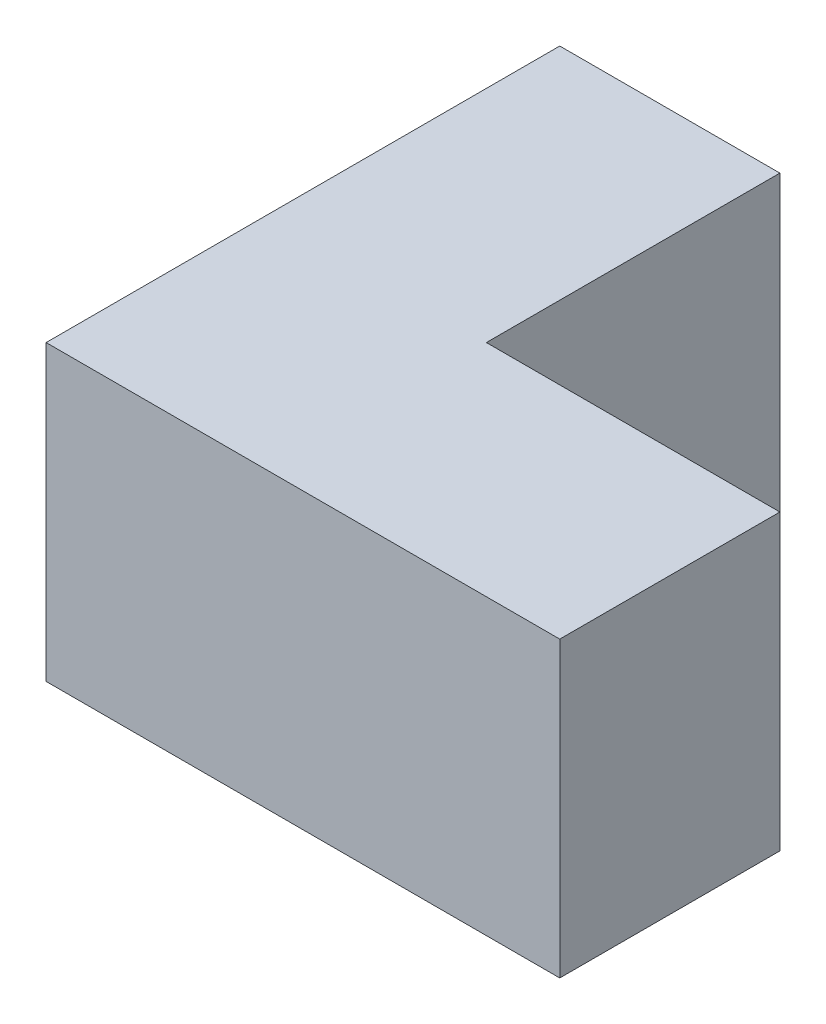
ISO-10303-21;
HEADER;
FILE_DESCRIPTION(('STEP AP214'),'2;1');
FILE_NAME('part.step','',(''),(''),'','','');
FILE_SCHEMA(('AUTOMOTIVE_DESIGN { 1 0 10303 214 1 1 1 1 }'));
ENDSEC;
DATA;
#1=APPLICATION_CONTEXT('core data for automotive mechanical design processes');
#2=APPLICATION_PROTOCOL_DEFINITION('international standard','automotive_design',2000,#1);
#3=PRODUCT_CONTEXT('',#1,'mechanical');
#4=PRODUCT('Part','Part','',(#3));
#5=PRODUCT_RELATED_PRODUCT_CATEGORY('part','',(#4));
#6=PRODUCT_DEFINITION_FORMATION('','',#4);
#7=PRODUCT_DEFINITION_CONTEXT('part definition',#1,'design');
#8=PRODUCT_DEFINITION('design','',#6,#7);
#9=PRODUCT_DEFINITION_SHAPE('','',#8);
#10=(LENGTH_UNIT() NAMED_UNIT(*) SI_UNIT(.MILLI.,.METRE.));
#11=(NAMED_UNIT(*) PLANE_ANGLE_UNIT() SI_UNIT($,.RADIAN.));
#12=(NAMED_UNIT(*) SI_UNIT($,.STERADIAN.) SOLID_ANGLE_UNIT());
#13=UNCERTAINTY_MEASURE_WITH_UNIT(LENGTH_MEASURE(1.E-05),#10,'distance_accuracy_value','');
#14=(GEOMETRIC_REPRESENTATION_CONTEXT(3) GLOBAL_UNCERTAINTY_ASSIGNED_CONTEXT((#13)) GLOBAL_UNIT_ASSIGNED_CONTEXT((#10,
#11,#12)) REPRESENTATION_CONTEXT('',''));
#15=CARTESIAN_POINT('',(0.,0.,0.));
#16=DIRECTION('',(0.,0.,1.));
#17=DIRECTION('',(1.,0.,0.));
#18=AXIS2_PLACEMENT_3D('',#15,#16,#17);
#19=CARTESIAN_POINT('',(20.,10.,0.));
#20=DIRECTION('',(0.,0.,1.));
#21=DIRECTION('',(1.,0.,0.));
#22=AXIS2_PLACEMENT_3D('',#19,#20,#21);
#23=PLANE('',#22);
#24=DIRECTION('',(-1.,0.,0.));
#25=VECTOR('',#24,1.);
#26=CARTESIAN_POINT('',(20.,-10.,0.));
#27=LINE('',#26,#25);
#28=CARTESIAN_POINT('',(20.,-10.,0.));
#29=VERTEX_POINT('',#28);
#30=CARTESIAN_POINT('',(0.,-10.,0.));
#31=VERTEX_POINT('',#30);
#32=EDGE_CURVE('E117',#29,#31,#27,.T.);
#33=ORIENTED_EDGE('',*,*,#32,.T.);
#34=DIRECTION('',(0.,-1.,0.));
#35=VECTOR('',#34,1.);
#36=CARTESIAN_POINT('',(0.,10.,0.));
#37=LINE('',#36,#35);
#38=CARTESIAN_POINT('',(0.,10.,0.));
#39=VERTEX_POINT('',#38);
#40=EDGE_CURVE('E11',#39,#31,#37,.T.);
#41=ORIENTED_EDGE('',*,*,#40,.F.);
#42=DIRECTION('',(-1.,0.,0.));
#43=VECTOR('',#42,1.);
#44=CARTESIAN_POINT('',(20.,10.,0.));
#45=LINE('',#44,#43);
#46=CARTESIAN_POINT('',(20.,10.,0.));
#47=VERTEX_POINT('',#46);
#48=EDGE_CURVE('E127',#47,#39,#45,.T.);
#49=ORIENTED_EDGE('',*,*,#48,.F.);
#50=DIRECTION('',(0.,-1.,0.));
#51=VECTOR('',#50,1.);
#52=CARTESIAN_POINT('',(20.,10.,0.));
#53=LINE('',#52,#51);
#54=EDGE_CURVE('E113',#47,#29,#53,.T.);
#55=ORIENTED_EDGE('',*,*,#54,.T.);
#56=EDGE_LOOP('',(#33,#41,#49,#55));
#57=FACE_BOUND('',#56,.T.);
#58=ADVANCED_FACE('F33',(#57),#23,.F.);
#59=CARTESIAN_POINT('',(0.,10.,0.));
#60=DIRECTION('',(-1.,0.,0.));
#61=DIRECTION('',(0.,0.,1.));
#62=AXIS2_PLACEMENT_3D('',#59,#60,#61);
#63=PLANE('',#62);
#64=DIRECTION('',(0.,0.,-1.));
#65=VECTOR('',#64,1.);
#66=CARTESIAN_POINT('',(0.,-10.,0.));
#67=LINE('',#66,#65);
#68=CARTESIAN_POINT('',(0.,-10.,-20.));
#69=VERTEX_POINT('',#68);
#70=EDGE_CURVE('E120',#31,#69,#67,.T.);
#71=ORIENTED_EDGE('',*,*,#70,.T.);
#72=DIRECTION('',(0.,-1.,0.));
#73=VECTOR('',#72,1.);
#74=CARTESIAN_POINT('',(0.,10.,-20.));
#75=LINE('',#74,#73);
#76=CARTESIAN_POINT('',(0.,10.,-20.));
#77=VERTEX_POINT('',#76);
#78=EDGE_CURVE('E41',#77,#69,#75,.T.);
#79=ORIENTED_EDGE('',*,*,#78,.F.);
#80=DIRECTION('',(0.,0.,-1.));
#81=VECTOR('',#80,1.);
#82=CARTESIAN_POINT('',(0.,10.,0.));
#83=LINE('',#82,#81);
#84=EDGE_CURVE('E86',#39,#77,#83,.T.);
#85=ORIENTED_EDGE('',*,*,#84,.F.);
#86=ORIENTED_EDGE('',*,*,#40,.T.);
#87=EDGE_LOOP('',(#71,#79,#85,#86));
#88=FACE_BOUND('',#87,.T.);
#89=ADVANCED_FACE('F151',(#88),#63,.F.);
#90=CARTESIAN_POINT('',(0.,10.,-20.));
#91=DIRECTION('',(0.,0.,1.));
#92=DIRECTION('',(1.,0.,0.));
#93=AXIS2_PLACEMENT_3D('',#90,#91,#92);
#94=PLANE('',#93);
#95=DIRECTION('',(-1.,0.,0.));
#96=VECTOR('',#95,1.);
#97=CARTESIAN_POINT('',(0.,-10.,-20.));
#98=LINE('',#97,#96);
#99=CARTESIAN_POINT('',(-15.,-10.,-20.));
#100=VERTEX_POINT('',#99);
#101=EDGE_CURVE('E122',#69,#100,#98,.T.);
#102=ORIENTED_EDGE('',*,*,#101,.T.);
#103=DIRECTION('',(0.,-1.,0.));
#104=VECTOR('',#103,1.);
#105=CARTESIAN_POINT('',(-15.,10.,-20.));
#106=LINE('',#105,#104);
#107=CARTESIAN_POINT('',(-15.,10.,-20.));
#108=VERTEX_POINT('',#107);
#109=EDGE_CURVE('E108',#108,#100,#106,.T.);
#110=ORIENTED_EDGE('',*,*,#109,.F.);
#111=DIRECTION('',(-1.,0.,0.));
#112=VECTOR('',#111,1.);
#113=CARTESIAN_POINT('',(0.,10.,-20.));
#114=LINE('',#113,#112);
#115=EDGE_CURVE('E99',#77,#108,#114,.T.);
#116=ORIENTED_EDGE('',*,*,#115,.F.);
#117=ORIENTED_EDGE('',*,*,#78,.T.);
#118=EDGE_LOOP('',(#102,#110,#116,#117));
#119=FACE_BOUND('',#118,.T.);
#120=ADVANCED_FACE('F133',(#119),#94,.F.);
#121=CARTESIAN_POINT('',(-15.,10.,-20.));
#122=DIRECTION('',(1.,0.,0.));
#123=DIRECTION('',(0.,0.,-1.));
#124=AXIS2_PLACEMENT_3D('',#121,#122,#123);
#125=PLANE('',#124);
#126=DIRECTION('',(0.,0.,1.));
#127=VECTOR('',#126,1.);
#128=CARTESIAN_POINT('',(-15.,-10.,-20.));
#129=LINE('',#128,#127);
#130=CARTESIAN_POINT('',(-15.,-10.,15.));
#131=VERTEX_POINT('',#130);
#132=EDGE_CURVE('E107',#100,#131,#129,.T.);
#133=ORIENTED_EDGE('',*,*,#132,.T.);
#134=DIRECTION('',(0.,-1.,0.));
#135=VECTOR('',#134,1.);
#136=CARTESIAN_POINT('',(-15.,10.,15.));
#137=LINE('',#136,#135);
#138=CARTESIAN_POINT('',(-15.,10.,15.));
#139=VERTEX_POINT('',#138);
#140=EDGE_CURVE('E104',#139,#131,#137,.T.);
#141=ORIENTED_EDGE('',*,*,#140,.F.);
#142=DIRECTION('',(0.,0.,1.));
#143=VECTOR('',#142,1.);
#144=CARTESIAN_POINT('',(-15.,10.,-20.));
#145=LINE('',#144,#143);
#146=EDGE_CURVE('E93',#108,#139,#145,.T.);
#147=ORIENTED_EDGE('',*,*,#146,.F.);
#148=ORIENTED_EDGE('',*,*,#109,.T.);
#149=EDGE_LOOP('',(#133,#141,#147,#148));
#150=FACE_BOUND('',#149,.T.);
#151=ADVANCED_FACE('F105',(#150),#125,.F.);
#152=CARTESIAN_POINT('',(-15.,10.,15.));
#153=DIRECTION('',(0.,0.,-1.));
#154=DIRECTION('',(-1.,0.,0.));
#155=AXIS2_PLACEMENT_3D('',#152,#153,#154);
#156=PLANE('',#155);
#157=DIRECTION('',(1.,0.,0.));
#158=VECTOR('',#157,1.);
#159=CARTESIAN_POINT('',(-15.,-10.,15.));
#160=LINE('',#159,#158);
#161=CARTESIAN_POINT('',(20.,-10.,15.));
#162=VERTEX_POINT('',#161);
#163=EDGE_CURVE('E72',#131,#162,#160,.T.);
#164=ORIENTED_EDGE('',*,*,#163,.T.);
#165=DIRECTION('',(0.,-1.,0.));
#166=VECTOR('',#165,1.);
#167=CARTESIAN_POINT('',(20.,10.,15.));
#168=LINE('',#167,#166);
#169=CARTESIAN_POINT('',(20.,10.,15.));
#170=VERTEX_POINT('',#169);
#171=EDGE_CURVE('E109',#170,#162,#168,.T.);
#172=ORIENTED_EDGE('',*,*,#171,.F.);
#173=DIRECTION('',(1.,0.,0.));
#174=VECTOR('',#173,1.);
#175=CARTESIAN_POINT('',(-15.,10.,15.));
#176=LINE('',#175,#174);
#177=EDGE_CURVE('E97',#139,#170,#176,.T.);
#178=ORIENTED_EDGE('',*,*,#177,.F.);
#179=ORIENTED_EDGE('',*,*,#140,.T.);
#180=EDGE_LOOP('',(#164,#172,#178,#179));
#181=FACE_BOUND('',#180,.T.);
#182=ADVANCED_FACE('F111',(#181),#156,.F.);
#183=CARTESIAN_POINT('',(20.,10.,15.));
#184=DIRECTION('',(-1.,0.,0.));
#185=DIRECTION('',(0.,0.,1.));
#186=AXIS2_PLACEMENT_3D('',#183,#184,#185);
#187=PLANE('',#186);
#188=DIRECTION('',(0.,0.,-1.));
#189=VECTOR('',#188,1.);
#190=CARTESIAN_POINT('',(20.,-10.,15.));
#191=LINE('',#190,#189);
#192=EDGE_CURVE('E78',#162,#29,#191,.T.);
#193=ORIENTED_EDGE('',*,*,#192,.T.);
#194=ORIENTED_EDGE('',*,*,#54,.F.);
#195=DIRECTION('',(0.,0.,-1.));
#196=VECTOR('',#195,1.);
#197=CARTESIAN_POINT('',(20.,10.,15.));
#198=LINE('',#197,#196);
#199=EDGE_CURVE('E49',#170,#47,#198,.T.);
#200=ORIENTED_EDGE('',*,*,#199,.F.);
#201=ORIENTED_EDGE('',*,*,#171,.T.);
#202=EDGE_LOOP('',(#193,#194,#200,#201));
#203=FACE_BOUND('',#202,.T.);
#204=ADVANCED_FACE('F140',(#203),#187,.F.);
#205=CARTESIAN_POINT('',(0.,10.,0.));
#206=DIRECTION('',(0.,-1.,0.));
#207=DIRECTION('',(0.,0.,-1.));
#208=AXIS2_PLACEMENT_3D('',#205,#206,#207);
#209=PLANE('',#208);
#210=ORIENTED_EDGE('',*,*,#48,.T.);
#211=ORIENTED_EDGE('',*,*,#84,.T.);
#212=ORIENTED_EDGE('',*,*,#115,.T.);
#213=ORIENTED_EDGE('',*,*,#146,.T.);
#214=ORIENTED_EDGE('',*,*,#177,.T.);
#215=ORIENTED_EDGE('',*,*,#199,.T.);
#216=EDGE_LOOP('',(#210,#211,#212,#213,#214,#215));
#217=FACE_BOUND('',#216,.T.);
#218=ADVANCED_FACE('F95',(#217),#209,.F.);
#219=CARTESIAN_POINT('',(0.,-10.,0.));
#220=DIRECTION('',(0.,-1.,0.));
#221=DIRECTION('',(0.,0.,-1.));
#222=AXIS2_PLACEMENT_3D('',#219,#220,#221);
#223=PLANE('',#222);
#224=ORIENTED_EDGE('',*,*,#32,.F.);
#225=ORIENTED_EDGE('',*,*,#192,.F.);
#226=ORIENTED_EDGE('',*,*,#163,.F.);
#227=ORIENTED_EDGE('',*,*,#132,.F.);
#228=ORIENTED_EDGE('',*,*,#101,.F.);
#229=ORIENTED_EDGE('',*,*,#70,.F.);
#230=EDGE_LOOP('',(#224,#225,#226,#227,#228,#229));
#231=FACE_BOUND('',#230,.T.);
#232=ADVANCED_FACE('F136',(#231),#223,.T.);
#233=CLOSED_SHELL('',(#58,#89,#120,#151,#182,#204,#218,#232));
#234=MANIFOLD_SOLID_BREP('B2',#233);
#235=ADVANCED_BREP_SHAPE_REPRESENTATION('',(#18,#234),#14);
#236=SHAPE_DEFINITION_REPRESENTATION(#9,#235);
ENDSEC;
END-ISO-10303-21;
